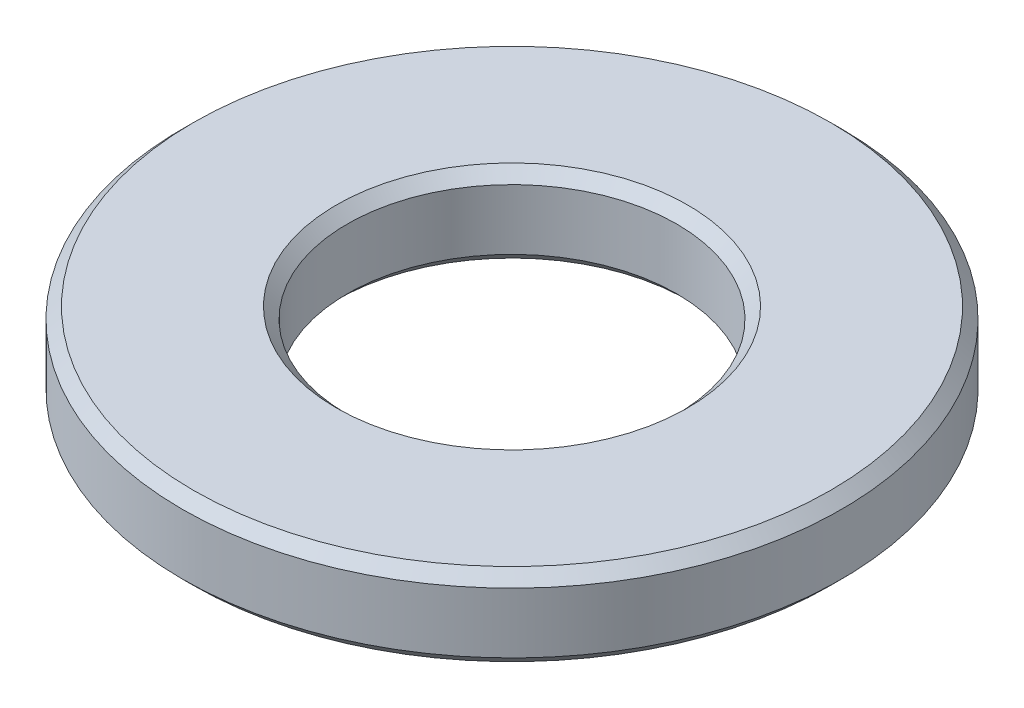
ISO-10303-21;
HEADER;
FILE_DESCRIPTION(('STEP AP214'),'2;1');
FILE_NAME('part.step','',(''),(''),'','','');
FILE_SCHEMA(('AUTOMOTIVE_DESIGN { 1 0 10303 214 1 1 1 1 }'));
ENDSEC;
DATA;
#1=APPLICATION_CONTEXT('core data for automotive mechanical design processes');
#2=APPLICATION_PROTOCOL_DEFINITION('international standard','automotive_design',2000,#1);
#3=PRODUCT_CONTEXT('',#1,'mechanical');
#4=PRODUCT('Part','Part','',(#3));
#5=PRODUCT_RELATED_PRODUCT_CATEGORY('part','',(#4));
#6=PRODUCT_DEFINITION_FORMATION('','',#4);
#7=PRODUCT_DEFINITION_CONTEXT('part definition',#1,'design');
#8=PRODUCT_DEFINITION('design','',#6,#7);
#9=PRODUCT_DEFINITION_SHAPE('','',#8);
#10=(LENGTH_UNIT() NAMED_UNIT(*) SI_UNIT(.MILLI.,.METRE.));
#11=(NAMED_UNIT(*) PLANE_ANGLE_UNIT() SI_UNIT($,.RADIAN.));
#12=(NAMED_UNIT(*) SI_UNIT($,.STERADIAN.) SOLID_ANGLE_UNIT());
#13=UNCERTAINTY_MEASURE_WITH_UNIT(LENGTH_MEASURE(1.E-05),#10,'distance_accuracy_value','');
#14=(GEOMETRIC_REPRESENTATION_CONTEXT(3) GLOBAL_UNCERTAINTY_ASSIGNED_CONTEXT((#13)) GLOBAL_UNIT_ASSIGNED_CONTEXT((#10,
#11,#12)) REPRESENTATION_CONTEXT('',''));
#15=CARTESIAN_POINT('',(0.,0.,0.));
#16=DIRECTION('',(0.,0.,1.));
#17=DIRECTION('',(1.,0.,0.));
#18=AXIS2_PLACEMENT_3D('',#15,#16,#17);
#19=CARTESIAN_POINT('',(0.,1.5,0.));
#20=DIRECTION('',(0.,1.,0.));
#21=DIRECTION('',(0.,0.,1.));
#22=AXIS2_PLACEMENT_3D('',#19,#20,#21);
#23=PLANE('',#22);
#24=CARTESIAN_POINT('',(0.,1.5,0.));
#25=DIRECTION('',(0.,1.,0.));
#26=DIRECTION('',(0.,0.,1.));
#27=AXIS2_PLACEMENT_3D('',#24,#25,#26);
#28=CIRCLE('',#27,5.8);
#29=CARTESIAN_POINT('',(0.,1.5,5.8));
#30=VERTEX_POINT('',#29);
#31=EDGE_CURVE('E10',#30,#30,#28,.T.);
#32=ORIENTED_EDGE('',*,*,#31,.T.);
#33=EDGE_LOOP('',(#32));
#34=FACE_BOUND('',#33,.T.);
#35=CARTESIAN_POINT('',(0.,1.5,0.));
#36=DIRECTION('',(0.,1.,0.));
#37=DIRECTION('',(0.,0.,1.));
#38=AXIS2_PLACEMENT_3D('',#35,#36,#37);
#39=CIRCLE('',#38,3.2);
#40=CARTESIAN_POINT('',(0.,1.5,3.2));
#41=VERTEX_POINT('',#40);
#42=EDGE_CURVE('E43',#41,#41,#39,.F.);
#43=ORIENTED_EDGE('',*,*,#42,.T.);
#44=EDGE_LOOP('',(#43));
#45=FACE_BOUND('',#44,.T.);
#46=ADVANCED_FACE('F35',(#34,#45),#23,.T.);
#47=CARTESIAN_POINT('',(0.,0.,0.));
#48=DIRECTION('',(0.,1.,0.));
#49=DIRECTION('',(0.,0.,1.));
#50=AXIS2_PLACEMENT_3D('',#47,#48,#49);
#51=PLANE('',#50);
#52=CARTESIAN_POINT('',(0.,0.,0.));
#53=DIRECTION('',(0.,1.,0.));
#54=DIRECTION('',(0.,0.,1.));
#55=AXIS2_PLACEMENT_3D('',#52,#53,#54);
#56=CIRCLE('',#55,3.2);
#57=CARTESIAN_POINT('',(0.,0.,3.2));
#58=VERTEX_POINT('',#57);
#59=EDGE_CURVE('E62',#58,#58,#56,.T.);
#60=ORIENTED_EDGE('',*,*,#59,.T.);
#61=EDGE_LOOP('',(#60));
#62=FACE_BOUND('',#61,.T.);
#63=CARTESIAN_POINT('',(0.,0.,0.));
#64=DIRECTION('',(0.,1.,0.));
#65=DIRECTION('',(0.,0.,1.));
#66=AXIS2_PLACEMENT_3D('',#63,#64,#65);
#67=CIRCLE('',#66,5.8);
#68=CARTESIAN_POINT('',(0.,0.,5.8));
#69=VERTEX_POINT('',#68);
#70=EDGE_CURVE('E65',#69,#69,#67,.F.);
#71=ORIENTED_EDGE('',*,*,#70,.T.);
#72=EDGE_LOOP('',(#71));
#73=FACE_BOUND('',#72,.T.);
#74=ADVANCED_FACE('F69',(#62,#73),#51,.F.);
#75=CARTESIAN_POINT('',(0.,1.5,0.));
#76=DIRECTION('',(0.,-1.,0.));
#77=DIRECTION('',(0.,0.,-1.));
#78=AXIS2_PLACEMENT_3D('',#75,#76,#77);
#79=CYLINDRICAL_SURFACE('',#78,6.);
#80=CARTESIAN_POINT('',(0.,0.199999999999999,0.));
#81=DIRECTION('',(0.,1.,0.));
#82=DIRECTION('',(0.,0.,1.));
#83=AXIS2_PLACEMENT_3D('',#80,#81,#82);
#84=CIRCLE('',#83,6.);
#85=CARTESIAN_POINT('',(0.,0.199999999999999,6.));
#86=VERTEX_POINT('',#85);
#87=EDGE_CURVE('E47',#86,#86,#84,.T.);
#88=ORIENTED_EDGE('',*,*,#87,.T.);
#89=EDGE_LOOP('',(#88));
#90=FACE_BOUND('',#89,.T.);
#91=CARTESIAN_POINT('',(0.,1.29999999999999,0.));
#92=DIRECTION('',(0.,1.,0.));
#93=DIRECTION('',(0.,0.,1.));
#94=AXIS2_PLACEMENT_3D('',#91,#92,#93);
#95=CIRCLE('',#94,6.);
#96=CARTESIAN_POINT('',(0.,1.29999999999999,6.));
#97=VERTEX_POINT('',#96);
#98=EDGE_CURVE('E51',#97,#97,#95,.F.);
#99=ORIENTED_EDGE('',*,*,#98,.T.);
#100=EDGE_LOOP('',(#99));
#101=FACE_BOUND('',#100,.T.);
#102=ADVANCED_FACE('F79',(#90,#101),#79,.T.);
#103=CARTESIAN_POINT('',(0.,1.5,0.));
#104=DIRECTION('',(0.,-1.,0.));
#105=DIRECTION('',(0.,0.,-1.));
#106=AXIS2_PLACEMENT_3D('',#103,#104,#105);
#107=CYLINDRICAL_SURFACE('',#106,3.);
#108=CARTESIAN_POINT('',(0.,0.200000000000001,0.));
#109=DIRECTION('',(0.,1.,0.));
#110=DIRECTION('',(0.,0.,1.));
#111=AXIS2_PLACEMENT_3D('',#108,#109,#110);
#112=CIRCLE('',#111,3.);
#113=CARTESIAN_POINT('',(0.,0.200000000000001,3.));
#114=VERTEX_POINT('',#113);
#115=EDGE_CURVE('E56',#114,#114,#112,.F.);
#116=ORIENTED_EDGE('',*,*,#115,.T.);
#117=EDGE_LOOP('',(#116));
#118=FACE_BOUND('',#117,.T.);
#119=CARTESIAN_POINT('',(0.,1.3,0.));
#120=DIRECTION('',(0.,1.,0.));
#121=DIRECTION('',(0.,0.,1.));
#122=AXIS2_PLACEMENT_3D('',#119,#120,#121);
#123=CIRCLE('',#122,3.);
#124=CARTESIAN_POINT('',(0.,1.3,3.));
#125=VERTEX_POINT('',#124);
#126=EDGE_CURVE('E59',#125,#125,#123,.T.);
#127=ORIENTED_EDGE('',*,*,#126,.T.);
#128=EDGE_LOOP('',(#127));
#129=FACE_BOUND('',#128,.T.);
#130=ADVANCED_FACE('F82',(#118,#129),#107,.F.);
#131=CARTESIAN_POINT('',(0.,0.,0.));
#132=DIRECTION('',(0.,-1.,0.));
#133=DIRECTION('',(0.,0.,-1.));
#134=AXIS2_PLACEMENT_3D('',#131,#132,#133);
#135=CONICAL_SURFACE('',#134,3.2,0.785398163397446);
#136=ORIENTED_EDGE('',*,*,#115,.F.);
#137=EDGE_LOOP('',(#136));
#138=FACE_BOUND('',#137,.T.);
#139=ORIENTED_EDGE('',*,*,#59,.F.);
#140=EDGE_LOOP('',(#139));
#141=FACE_BOUND('',#140,.T.);
#142=ADVANCED_FACE('F75',(#138,#141),#135,.F.);
#143=CARTESIAN_POINT('',(0.,0.199999999999999,0.));
#144=DIRECTION('',(0.,1.,0.));
#145=DIRECTION('',(0.,0.,1.));
#146=AXIS2_PLACEMENT_3D('',#143,#144,#145);
#147=CONICAL_SURFACE('',#146,6.,0.785398163397448);
#148=ORIENTED_EDGE('',*,*,#70,.F.);
#149=EDGE_LOOP('',(#148));
#150=FACE_BOUND('',#149,.T.);
#151=ORIENTED_EDGE('',*,*,#87,.F.);
#152=EDGE_LOOP('',(#151));
#153=FACE_BOUND('',#152,.T.);
#154=ADVANCED_FACE('F71',(#150,#153),#147,.T.);
#155=CARTESIAN_POINT('',(0.,1.5,0.));
#156=DIRECTION('',(0.,-1.,0.));
#157=DIRECTION('',(0.,0.,-1.));
#158=AXIS2_PLACEMENT_3D('',#155,#156,#157);
#159=CONICAL_SURFACE('',#158,5.8,0.78539816339744);
#160=ORIENTED_EDGE('',*,*,#98,.F.);
#161=EDGE_LOOP('',(#160));
#162=FACE_BOUND('',#161,.T.);
#163=ORIENTED_EDGE('',*,*,#31,.F.);
#164=EDGE_LOOP('',(#163));
#165=FACE_BOUND('',#164,.T.);
#166=ADVANCED_FACE('F74',(#162,#165),#159,.T.);
#167=CARTESIAN_POINT('',(0.,1.3,0.));
#168=DIRECTION('',(0.,1.,0.));
#169=DIRECTION('',(0.,0.,1.));
#170=AXIS2_PLACEMENT_3D('',#167,#168,#169);
#171=CONICAL_SURFACE('',#170,3.,0.785398163397449);
#172=ORIENTED_EDGE('',*,*,#42,.F.);
#173=EDGE_LOOP('',(#172));
#174=FACE_BOUND('',#173,.T.);
#175=ORIENTED_EDGE('',*,*,#126,.F.);
#176=EDGE_LOOP('',(#175));
#177=FACE_BOUND('',#176,.T.);
#178=ADVANCED_FACE('F38',(#174,#177),#171,.F.);
#179=CLOSED_SHELL('',(#46,#74,#102,#130,#142,#154,#166,#178));
#180=MANIFOLD_SOLID_BREP('B2',#179);
#181=ADVANCED_BREP_SHAPE_REPRESENTATION('',(#18,#180),#14);
#182=SHAPE_DEFINITION_REPRESENTATION(#9,#181);
ENDSEC;
END-ISO-10303-21;
